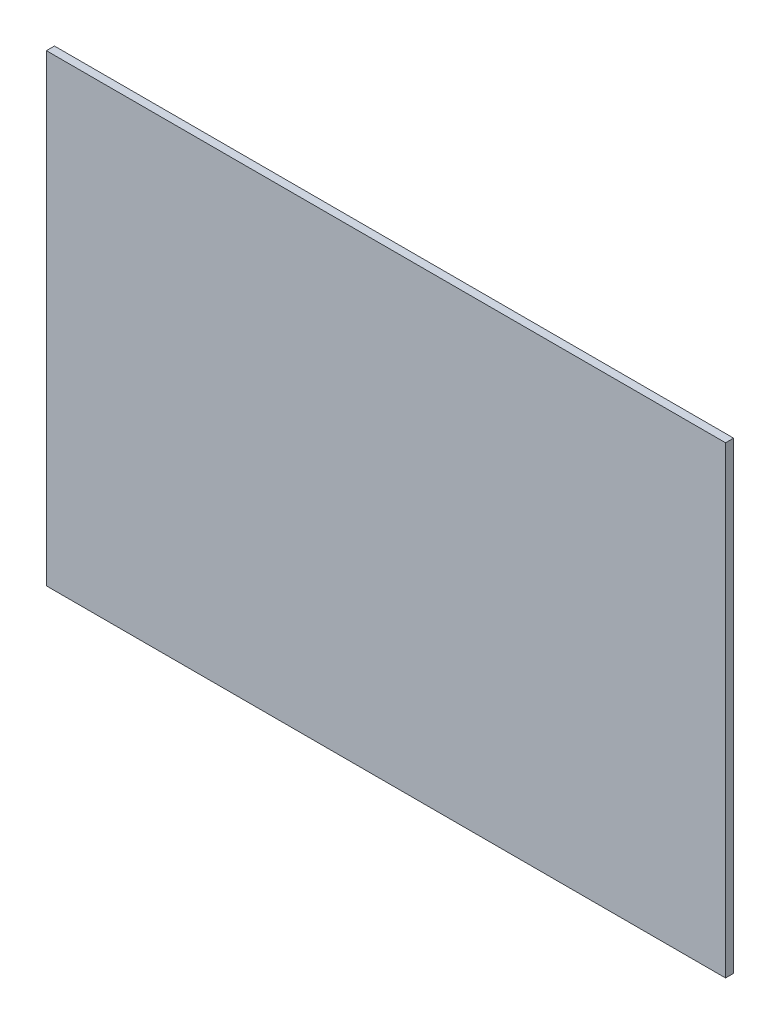
ISO-10303-21;
HEADER;
FILE_DESCRIPTION(('STEP AP214'),'2;1');
FILE_NAME('part.step','',(''),(''),'','','');
FILE_SCHEMA(('AUTOMOTIVE_DESIGN { 1 0 10303 214 1 1 1 1 }'));
ENDSEC;
DATA;
#1=APPLICATION_CONTEXT('core data for automotive mechanical design processes');
#2=APPLICATION_PROTOCOL_DEFINITION('international standard','automotive_design',2000,#1);
#3=PRODUCT_CONTEXT('',#1,'mechanical');
#4=PRODUCT('Part','Part','',(#3));
#5=PRODUCT_RELATED_PRODUCT_CATEGORY('part','',(#4));
#6=PRODUCT_DEFINITION_FORMATION('','',#4);
#7=PRODUCT_DEFINITION_CONTEXT('part definition',#1,'design');
#8=PRODUCT_DEFINITION('design','',#6,#7);
#9=PRODUCT_DEFINITION_SHAPE('','',#8);
#10=(LENGTH_UNIT() NAMED_UNIT(*) SI_UNIT(.MILLI.,.METRE.));
#11=(NAMED_UNIT(*) PLANE_ANGLE_UNIT() SI_UNIT($,.RADIAN.));
#12=(NAMED_UNIT(*) SI_UNIT($,.STERADIAN.) SOLID_ANGLE_UNIT());
#13=UNCERTAINTY_MEASURE_WITH_UNIT(LENGTH_MEASURE(1.E-05),#10,'distance_accuracy_value','');
#14=(GEOMETRIC_REPRESENTATION_CONTEXT(3) GLOBAL_UNCERTAINTY_ASSIGNED_CONTEXT((#13)) GLOBAL_UNIT_ASSIGNED_CONTEXT((#10,
#11,#12)) REPRESENTATION_CONTEXT('',''));
#15=CARTESIAN_POINT('',(0.,0.,0.));
#16=DIRECTION('',(0.,0.,1.));
#17=DIRECTION('',(1.,0.,0.));
#18=AXIS2_PLACEMENT_3D('',#15,#16,#17);
#19=CARTESIAN_POINT('',(0.,0.,4.));
#20=DIRECTION('',(1.,0.,0.));
#21=DIRECTION('',(0.,0.,-1.));
#22=AXIS2_PLACEMENT_3D('',#19,#20,#21);
#23=PLANE('',#22);
#24=DIRECTION('',(0.,-1.,0.));
#25=VECTOR('',#24,1.);
#26=CARTESIAN_POINT('',(0.,0.,0.));
#27=LINE('',#26,#25);
#28=CARTESIAN_POINT('',(0.,230.,0.));
#29=VERTEX_POINT('',#28);
#30=CARTESIAN_POINT('',(0.,0.,0.));
#31=VERTEX_POINT('',#30);
#32=EDGE_CURVE('E97',#29,#31,#27,.T.);
#33=ORIENTED_EDGE('',*,*,#32,.T.);
#34=DIRECTION('',(0.,0.,-1.));
#35=VECTOR('',#34,1.);
#36=CARTESIAN_POINT('',(0.,0.,4.));
#37=LINE('',#36,#35);
#38=CARTESIAN_POINT('',(0.,0.,4.));
#39=VERTEX_POINT('',#38);
#40=EDGE_CURVE('E11',#39,#31,#37,.T.);
#41=ORIENTED_EDGE('',*,*,#40,.F.);
#42=DIRECTION('',(0.,-1.,0.));
#43=VECTOR('',#42,1.);
#44=CARTESIAN_POINT('',(0.,0.,4.));
#45=LINE('',#44,#43);
#46=CARTESIAN_POINT('',(0.,230.,4.));
#47=VERTEX_POINT('',#46);
#48=EDGE_CURVE('E85',#47,#39,#45,.T.);
#49=ORIENTED_EDGE('',*,*,#48,.F.);
#50=DIRECTION('',(0.,0.,-1.));
#51=VECTOR('',#50,1.);
#52=CARTESIAN_POINT('',(0.,230.,4.));
#53=LINE('',#52,#51);
#54=EDGE_CURVE('E93',#47,#29,#53,.T.);
#55=ORIENTED_EDGE('',*,*,#54,.T.);
#56=EDGE_LOOP('',(#33,#41,#49,#55));
#57=FACE_BOUND('',#56,.T.);
#58=ADVANCED_FACE('F34',(#57),#23,.F.);
#59=CARTESIAN_POINT('',(0.,0.,4.));
#60=DIRECTION('',(0.,1.,0.));
#61=DIRECTION('',(0.,0.,1.));
#62=AXIS2_PLACEMENT_3D('',#59,#60,#61);
#63=PLANE('',#62);
#64=DIRECTION('',(1.,0.,0.));
#65=VECTOR('',#64,1.);
#66=CARTESIAN_POINT('',(0.,0.,0.));
#67=LINE('',#66,#65);
#68=CARTESIAN_POINT('',(337.,0.,0.));
#69=VERTEX_POINT('',#68);
#70=EDGE_CURVE('E89',#31,#69,#67,.T.);
#71=ORIENTED_EDGE('',*,*,#70,.T.);
#72=DIRECTION('',(0.,0.,-1.));
#73=VECTOR('',#72,1.);
#74=CARTESIAN_POINT('',(337.,0.,4.));
#75=LINE('',#74,#73);
#76=CARTESIAN_POINT('',(337.,0.,4.));
#77=VERTEX_POINT('',#76);
#78=EDGE_CURVE('E42',#77,#69,#75,.T.);
#79=ORIENTED_EDGE('',*,*,#78,.F.);
#80=DIRECTION('',(1.,0.,0.));
#81=VECTOR('',#80,1.);
#82=CARTESIAN_POINT('',(0.,0.,4.));
#83=LINE('',#82,#81);
#84=EDGE_CURVE('E80',#39,#77,#83,.T.);
#85=ORIENTED_EDGE('',*,*,#84,.F.);
#86=ORIENTED_EDGE('',*,*,#40,.T.);
#87=EDGE_LOOP('',(#71,#79,#85,#86));
#88=FACE_BOUND('',#87,.T.);
#89=ADVANCED_FACE('F88',(#88),#63,.F.);
#90=CARTESIAN_POINT('',(337.,0.,4.));
#91=DIRECTION('',(-1.,0.,0.));
#92=DIRECTION('',(0.,0.,1.));
#93=AXIS2_PLACEMENT_3D('',#90,#91,#92);
#94=PLANE('',#93);
#95=DIRECTION('',(0.,1.,0.));
#96=VECTOR('',#95,1.);
#97=CARTESIAN_POINT('',(337.,0.,0.));
#98=LINE('',#97,#96);
#99=CARTESIAN_POINT('',(337.,230.,0.));
#100=VERTEX_POINT('',#99);
#101=EDGE_CURVE('E67',#69,#100,#98,.T.);
#102=ORIENTED_EDGE('',*,*,#101,.T.);
#103=DIRECTION('',(0.,0.,-1.));
#104=VECTOR('',#103,1.);
#105=CARTESIAN_POINT('',(337.,230.,4.));
#106=LINE('',#105,#104);
#107=CARTESIAN_POINT('',(337.,230.,4.));
#108=VERTEX_POINT('',#107);
#109=EDGE_CURVE('E90',#108,#100,#106,.T.);
#110=ORIENTED_EDGE('',*,*,#109,.F.);
#111=DIRECTION('',(0.,1.,0.));
#112=VECTOR('',#111,1.);
#113=CARTESIAN_POINT('',(337.,0.,4.));
#114=LINE('',#113,#112);
#115=EDGE_CURVE('E83',#77,#108,#114,.T.);
#116=ORIENTED_EDGE('',*,*,#115,.F.);
#117=ORIENTED_EDGE('',*,*,#78,.T.);
#118=EDGE_LOOP('',(#102,#110,#116,#117));
#119=FACE_BOUND('',#118,.T.);
#120=ADVANCED_FACE('F91',(#119),#94,.F.);
#121=CARTESIAN_POINT('',(0.,230.,4.));
#122=DIRECTION('',(0.,-1.,0.));
#123=DIRECTION('',(0.,0.,-1.));
#124=AXIS2_PLACEMENT_3D('',#121,#122,#123);
#125=PLANE('',#124);
#126=DIRECTION('',(-1.,0.,0.));
#127=VECTOR('',#126,1.);
#128=CARTESIAN_POINT('',(0.,230.,0.));
#129=LINE('',#128,#127);
#130=EDGE_CURVE('E73',#100,#29,#129,.T.);
#131=ORIENTED_EDGE('',*,*,#130,.T.);
#132=ORIENTED_EDGE('',*,*,#54,.F.);
#133=DIRECTION('',(-1.,0.,0.));
#134=VECTOR('',#133,1.);
#135=CARTESIAN_POINT('',(0.,230.,4.));
#136=LINE('',#135,#134);
#137=EDGE_CURVE('E50',#108,#47,#136,.T.);
#138=ORIENTED_EDGE('',*,*,#137,.F.);
#139=ORIENTED_EDGE('',*,*,#109,.T.);
#140=EDGE_LOOP('',(#131,#132,#138,#139));
#141=FACE_BOUND('',#140,.T.);
#142=ADVANCED_FACE('F104',(#141),#125,.F.);
#143=CARTESIAN_POINT('',(0.,0.,4.));
#144=DIRECTION('',(0.,0.,-1.));
#145=DIRECTION('',(-1.,0.,0.));
#146=AXIS2_PLACEMENT_3D('',#143,#144,#145);
#147=PLANE('',#146);
#148=ORIENTED_EDGE('',*,*,#48,.T.);
#149=ORIENTED_EDGE('',*,*,#84,.T.);
#150=ORIENTED_EDGE('',*,*,#115,.T.);
#151=ORIENTED_EDGE('',*,*,#137,.T.);
#152=EDGE_LOOP('',(#148,#149,#150,#151));
#153=FACE_BOUND('',#152,.T.);
#154=ADVANCED_FACE('F81',(#153),#147,.F.);
#155=CARTESIAN_POINT('',(0.,0.,0.));
#156=DIRECTION('',(0.,0.,-1.));
#157=DIRECTION('',(-1.,0.,0.));
#158=AXIS2_PLACEMENT_3D('',#155,#156,#157);
#159=PLANE('',#158);
#160=ORIENTED_EDGE('',*,*,#32,.F.);
#161=ORIENTED_EDGE('',*,*,#130,.F.);
#162=ORIENTED_EDGE('',*,*,#101,.F.);
#163=ORIENTED_EDGE('',*,*,#70,.F.);
#164=EDGE_LOOP('',(#160,#161,#162,#163));
#165=FACE_BOUND('',#164,.T.);
#166=ADVANCED_FACE('F107',(#165),#159,.T.);
#167=CLOSED_SHELL('',(#58,#89,#120,#142,#154,#166));
#168=MANIFOLD_SOLID_BREP('B2',#167);
#169=ADVANCED_BREP_SHAPE_REPRESENTATION('',(#18,#168),#14);
#170=SHAPE_DEFINITION_REPRESENTATION(#9,#169);
ENDSEC;
END-ISO-10303-21;
